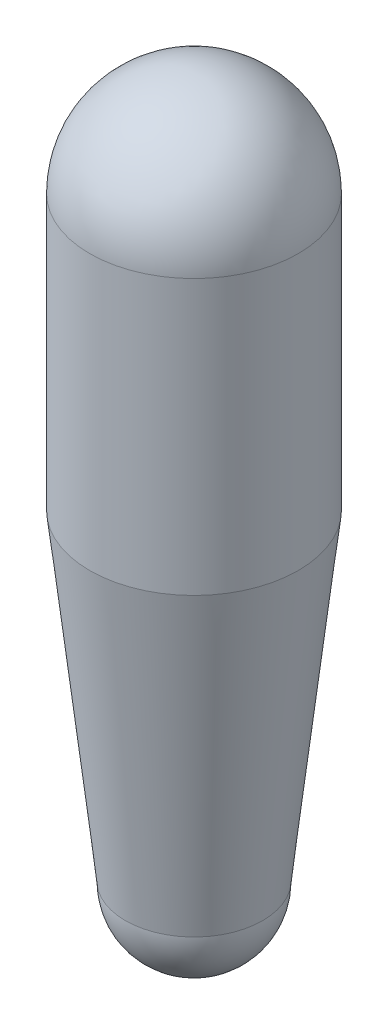
ISO-10303-21;
HEADER;
FILE_DESCRIPTION(('STEP AP214'),'2;1');
FILE_NAME('part.step','',(''),(''),'','','');
FILE_SCHEMA(('AUTOMOTIVE_DESIGN { 1 0 10303 214 1 1 1 1 }'));
ENDSEC;
DATA;
#1=APPLICATION_CONTEXT('core data for automotive mechanical design processes');
#2=APPLICATION_PROTOCOL_DEFINITION('international standard','automotive_design',2000,#1);
#3=PRODUCT_CONTEXT('',#1,'mechanical');
#4=PRODUCT('Part','Part','',(#3));
#5=PRODUCT_RELATED_PRODUCT_CATEGORY('part','',(#4));
#6=PRODUCT_DEFINITION_FORMATION('','',#4);
#7=PRODUCT_DEFINITION_CONTEXT('part definition',#1,'design');
#8=PRODUCT_DEFINITION('design','',#6,#7);
#9=PRODUCT_DEFINITION_SHAPE('','',#8);
#10=(LENGTH_UNIT() NAMED_UNIT(*) SI_UNIT(.MILLI.,.METRE.));
#11=(NAMED_UNIT(*) PLANE_ANGLE_UNIT() SI_UNIT($,.RADIAN.));
#12=(NAMED_UNIT(*) SI_UNIT($,.STERADIAN.) SOLID_ANGLE_UNIT());
#13=UNCERTAINTY_MEASURE_WITH_UNIT(LENGTH_MEASURE(1.E-05),#10,'distance_accuracy_value','');
#14=(GEOMETRIC_REPRESENTATION_CONTEXT(3) GLOBAL_UNCERTAINTY_ASSIGNED_CONTEXT((#13)) GLOBAL_UNIT_ASSIGNED_CONTEXT((#10,
#11,#12)) REPRESENTATION_CONTEXT('',''));
#15=CARTESIAN_POINT('',(0.,0.,0.));
#16=DIRECTION('',(0.,0.,1.));
#17=DIRECTION('',(1.,0.,0.));
#18=AXIS2_PLACEMENT_3D('',#15,#16,#17);
#19=CARTESIAN_POINT('',(0.,0.,0.));
#20=DIRECTION('',(-1.,0.,0.));
#21=DIRECTION('',(0.,1.,0.));
#22=AXIS2_PLACEMENT_3D('',#19,#20,#21);
#23=SPHERICAL_SURFACE('',#22,48.26);
#24=CARTESIAN_POINT('',(0.,0.,0.));
#25=DIRECTION('',(0.,1.,0.));
#26=DIRECTION('',(0.,0.,1.));
#27=AXIS2_PLACEMENT_3D('',#24,#25,#26);
#28=SPHERICAL_SURFACE('',#27,48.26);
#29=CARTESIAN_POINT('',(0.,0.,0.));
#30=DIRECTION('',(0.,1.,0.));
#31=DIRECTION('',(0.,0.,1.));
#32=AXIS2_PLACEMENT_3D('',#29,#30,#31);
#33=CIRCLE('',#32,48.26);
#34=CARTESIAN_POINT('',(0.,0.,48.2599999999999));
#35=VERTEX_POINT('',#34);
#36=EDGE_CURVE('E10',#35,#35,#33,.F.);
#37=ORIENTED_EDGE('',*,*,#36,.F.);
#38=EDGE_LOOP('',(#37));
#39=FACE_BOUND('',#38,.T.);
#40=ADVANCED_FACE('F14',(#39),#28,.T.);
#41=CARTESIAN_POINT('',(0.,-275.59,0.));
#42=DIRECTION('',(0.,1.,0.));
#43=DIRECTION('',(0.,0.,1.));
#44=AXIS2_PLACEMENT_3D('',#41,#42,#43);
#45=CONICAL_SURFACE('',#44,31.75,0.110657221173896);
#46=CARTESIAN_POINT('',(0.,-127.,0.));
#47=DIRECTION('',(0.,1.,0.));
#48=DIRECTION('',(0.,0.,1.));
#49=AXIS2_PLACEMENT_3D('',#46,#47,#48);
#50=CIRCLE('',#49,48.26);
#51=CARTESIAN_POINT('',(0.,-127.,48.26));
#52=VERTEX_POINT('',#51);
#53=EDGE_CURVE('E20',#52,#52,#50,.T.);
#54=ORIENTED_EDGE('',*,*,#53,.F.);
#55=EDGE_LOOP('',(#54));
#56=FACE_BOUND('',#55,.T.);
#57=CARTESIAN_POINT('',(0.,-275.589999999996,0.));
#58=DIRECTION('',(0.,-1.,0.));
#59=DIRECTION('',(0.,0.,-1.));
#60=AXIS2_PLACEMENT_3D('',#57,#58,#59);
#61=CIRCLE('',#60,31.7500000000004);
#62=CARTESIAN_POINT('',(0.,-275.589999999996,-31.7500000000004));
#63=VERTEX_POINT('',#62);
#64=EDGE_CURVE('E24',#63,#63,#61,.F.);
#65=ORIENTED_EDGE('',*,*,#64,.T.);
#66=EDGE_LOOP('',(#65));
#67=FACE_BOUND('',#66,.T.);
#68=ADVANCED_FACE('F31',(#56,#67),#45,.T.);
#69=CARTESIAN_POINT('',(0.,0.,0.));
#70=DIRECTION('',(0.,1.,0.));
#71=DIRECTION('',(0.,0.,1.));
#72=AXIS2_PLACEMENT_3D('',#69,#70,#71);
#73=CYLINDRICAL_SURFACE('',#72,48.26);
#74=ORIENTED_EDGE('',*,*,#36,.T.);
#75=EDGE_LOOP('',(#74));
#76=FACE_BOUND('',#75,.T.);
#77=ORIENTED_EDGE('',*,*,#53,.T.);
#78=EDGE_LOOP('',(#77));
#79=FACE_BOUND('',#78,.T.);
#80=ADVANCED_FACE('F35',(#76,#79),#73,.T.);
#81=CARTESIAN_POINT('',(0.,-275.59,0.));
#82=DIRECTION('',(-1.,0.,0.));
#83=DIRECTION('',(0.,1.,0.));
#84=AXIS2_PLACEMENT_3D('',#81,#82,#83);
#85=SPHERICAL_SURFACE('',#84,31.75);
#86=CARTESIAN_POINT('',(0.,-275.59,0.));
#87=DIRECTION('',(0.,-1.,0.));
#88=DIRECTION('',(0.,0.,-1.));
#89=AXIS2_PLACEMENT_3D('',#86,#87,#88);
#90=SPHERICAL_SURFACE('',#89,31.75);
#91=ORIENTED_EDGE('',*,*,#64,.F.);
#92=EDGE_LOOP('',(#91));
#93=FACE_BOUND('',#92,.T.);
#94=ADVANCED_FACE('F33',(#93),#90,.T.);
#95=CLOSED_SHELL('',(#40,#68,#80,#94));
#96=MANIFOLD_SOLID_BREP('B1',#95);
#97=ADVANCED_BREP_SHAPE_REPRESENTATION('',(#18,#96),#14);
#98=SHAPE_DEFINITION_REPRESENTATION(#9,#97);
ENDSEC;
END-ISO-10303-21;
